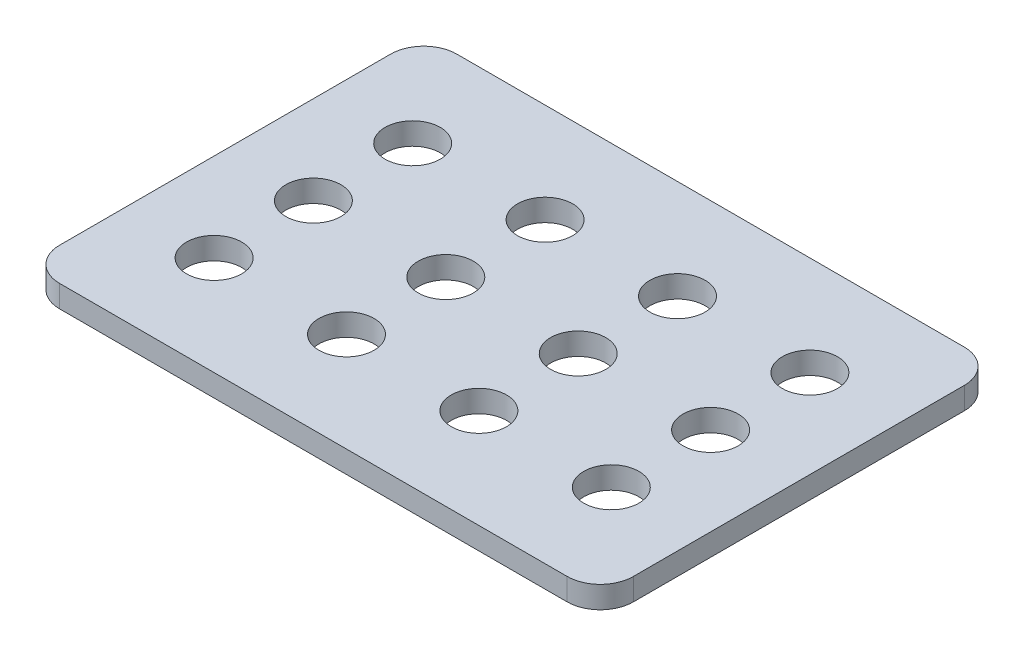
ISO-10303-21;
HEADER;
FILE_DESCRIPTION(('STEP AP214'),'2;1');
FILE_NAME('part.step','',(''),(''),'','','');
FILE_SCHEMA(('AUTOMOTIVE_DESIGN { 1 0 10303 214 1 1 1 1 }'));
ENDSEC;
DATA;
#1=APPLICATION_CONTEXT('core data for automotive mechanical design processes');
#2=APPLICATION_PROTOCOL_DEFINITION('international standard','automotive_design',2000,#1);
#3=PRODUCT_CONTEXT('',#1,'mechanical');
#4=PRODUCT('Part','Part','',(#3));
#5=PRODUCT_RELATED_PRODUCT_CATEGORY('part','',(#4));
#6=PRODUCT_DEFINITION_FORMATION('','',#4);
#7=PRODUCT_DEFINITION_CONTEXT('part definition',#1,'design');
#8=PRODUCT_DEFINITION('design','',#6,#7);
#9=PRODUCT_DEFINITION_SHAPE('','',#8);
#10=(LENGTH_UNIT() NAMED_UNIT(*) SI_UNIT(.MILLI.,.METRE.));
#11=(NAMED_UNIT(*) PLANE_ANGLE_UNIT() SI_UNIT($,.RADIAN.));
#12=(NAMED_UNIT(*) SI_UNIT($,.STERADIAN.) SOLID_ANGLE_UNIT());
#13=UNCERTAINTY_MEASURE_WITH_UNIT(LENGTH_MEASURE(1.E-05),#10,'distance_accuracy_value','');
#14=(GEOMETRIC_REPRESENTATION_CONTEXT(3) GLOBAL_UNCERTAINTY_ASSIGNED_CONTEXT((#13)) GLOBAL_UNIT_ASSIGNED_CONTEXT((#10,
#11,#12)) REPRESENTATION_CONTEXT('',''));
#15=CARTESIAN_POINT('',(0.,0.,0.));
#16=DIRECTION('',(0.,0.,1.));
#17=DIRECTION('',(1.,0.,0.));
#18=AXIS2_PLACEMENT_3D('',#15,#16,#17);
#19=CARTESIAN_POINT('',(-115.,5.,75.));
#20=DIRECTION('',(0.,-1.,0.));
#21=DIRECTION('',(0.,0.,-1.));
#22=AXIS2_PLACEMENT_3D('',#19,#20,#21);
#23=PLANE('',#22);
#24=CARTESIAN_POINT('',(-115.,5.,75.));
#25=DIRECTION('',(0.,1.,0.));
#26=DIRECTION('',(0.,0.,-1.));
#27=AXIS2_PLACEMENT_3D('',#24,#25,#26);
#28=CIRCLE('',#27,15.);
#29=CARTESIAN_POINT('',(-130.,5.,74.9999999999999));
#30=VERTEX_POINT('',#29);
#31=CARTESIAN_POINT('',(-115.,5.,90.));
#32=VERTEX_POINT('',#31);
#33=EDGE_CURVE('E168',#30,#32,#28,.T.);
#34=ORIENTED_EDGE('',*,*,#33,.T.);
#35=DIRECTION('',(1.,0.,0.));
#36=VECTOR('',#35,1.);
#37=CARTESIAN_POINT('',(-115.,5.,90.));
#38=LINE('',#37,#36);
#39=CARTESIAN_POINT('',(115.,5.,90.));
#40=VERTEX_POINT('',#39);
#41=EDGE_CURVE('E104',#32,#40,#38,.T.);
#42=ORIENTED_EDGE('',*,*,#41,.T.);
#43=CARTESIAN_POINT('',(115.,5.,75.));
#44=DIRECTION('',(0.,1.,0.));
#45=DIRECTION('',(0.,0.,1.));
#46=AXIS2_PLACEMENT_3D('',#43,#44,#45);
#47=CIRCLE('',#46,15.);
#48=CARTESIAN_POINT('',(130.,5.,74.9999999999999));
#49=VERTEX_POINT('',#48);
#50=EDGE_CURVE('E189',#40,#49,#47,.T.);
#51=ORIENTED_EDGE('',*,*,#50,.T.);
#52=DIRECTION('',(0.,0.,-1.));
#53=VECTOR('',#52,1.);
#54=CARTESIAN_POINT('',(130.,5.,74.9999999999999));
#55=LINE('',#54,#53);
#56=CARTESIAN_POINT('',(130.,5.,-74.9999999999999));
#57=VERTEX_POINT('',#56);
#58=EDGE_CURVE('E203',#49,#57,#55,.T.);
#59=ORIENTED_EDGE('',*,*,#58,.T.);
#60=CARTESIAN_POINT('',(115.,5.,-75.));
#61=DIRECTION('',(0.,1.,0.));
#62=DIRECTION('',(0.,0.,-1.));
#63=AXIS2_PLACEMENT_3D('',#60,#61,#62);
#64=CIRCLE('',#63,15.);
#65=CARTESIAN_POINT('',(115.,5.,-90.));
#66=VERTEX_POINT('',#65);
#67=EDGE_CURVE('E123',#57,#66,#64,.T.);
#68=ORIENTED_EDGE('',*,*,#67,.T.);
#69=DIRECTION('',(-1.,0.,0.));
#70=VECTOR('',#69,1.);
#71=CARTESIAN_POINT('',(-115.,5.,-90.));
#72=LINE('',#71,#70);
#73=CARTESIAN_POINT('',(-115.,5.,-90.));
#74=VERTEX_POINT('',#73);
#75=EDGE_CURVE('E117',#66,#74,#72,.T.);
#76=ORIENTED_EDGE('',*,*,#75,.T.);
#77=CARTESIAN_POINT('',(-115.,5.,-75.));
#78=DIRECTION('',(0.,1.,0.));
#79=DIRECTION('',(0.,0.,-1.));
#80=AXIS2_PLACEMENT_3D('',#77,#78,#79);
#81=CIRCLE('',#80,15.);
#82=CARTESIAN_POINT('',(-130.,5.,-74.9999999999999));
#83=VERTEX_POINT('',#82);
#84=EDGE_CURVE('E121',#74,#83,#81,.T.);
#85=ORIENTED_EDGE('',*,*,#84,.T.);
#86=DIRECTION('',(0.,0.,1.));
#87=VECTOR('',#86,1.);
#88=CARTESIAN_POINT('',(-130.,5.,74.9999999999999));
#89=LINE('',#88,#87);
#90=EDGE_CURVE('E61',#83,#30,#89,.T.);
#91=ORIENTED_EDGE('',*,*,#90,.T.);
#92=EDGE_LOOP('',(#34,#42,#51,#59,#68,#76,#85,#91));
#93=FACE_BOUND('',#92,.T.);
#94=CARTESIAN_POINT('',(-90.,5.,-45.));
#95=DIRECTION('',(0.,1.,0.));
#96=DIRECTION('',(0.,0.,1.));
#97=AXIS2_PLACEMENT_3D('',#94,#95,#96);
#98=CIRCLE('',#97,12.5);
#99=CARTESIAN_POINT('',(-90.,5.,-32.5));
#100=VERTEX_POINT('',#99);
#101=EDGE_CURVE('E150',#100,#100,#98,.T.);
#102=ORIENTED_EDGE('',*,*,#101,.F.);
#103=EDGE_LOOP('',(#102));
#104=FACE_BOUND('',#103,.T.);
#105=CARTESIAN_POINT('',(-30.,5.,-45.));
#106=DIRECTION('',(0.,1.,0.));
#107=DIRECTION('',(0.,0.,1.));
#108=AXIS2_PLACEMENT_3D('',#105,#106,#107);
#109=CIRCLE('',#108,12.5);
#110=CARTESIAN_POINT('',(-30.,5.,-32.5));
#111=VERTEX_POINT('',#110);
#112=EDGE_CURVE('E217',#111,#111,#109,.T.);
#113=ORIENTED_EDGE('',*,*,#112,.F.);
#114=EDGE_LOOP('',(#113));
#115=FACE_BOUND('',#114,.T.);
#116=CARTESIAN_POINT('',(30.,5.,-45.));
#117=DIRECTION('',(0.,1.,0.));
#118=DIRECTION('',(0.,0.,1.));
#119=AXIS2_PLACEMENT_3D('',#116,#117,#118);
#120=CIRCLE('',#119,12.5);
#121=CARTESIAN_POINT('',(30.,5.,-32.5));
#122=VERTEX_POINT('',#121);
#123=EDGE_CURVE('E225',#122,#122,#120,.T.);
#124=ORIENTED_EDGE('',*,*,#123,.F.);
#125=EDGE_LOOP('',(#124));
#126=FACE_BOUND('',#125,.T.);
#127=CARTESIAN_POINT('',(90.,5.,-45.));
#128=DIRECTION('',(0.,1.,0.));
#129=DIRECTION('',(0.,0.,1.));
#130=AXIS2_PLACEMENT_3D('',#127,#128,#129);
#131=CIRCLE('',#130,12.5);
#132=CARTESIAN_POINT('',(90.,5.,-32.5));
#133=VERTEX_POINT('',#132);
#134=EDGE_CURVE('E233',#133,#133,#131,.T.);
#135=ORIENTED_EDGE('',*,*,#134,.F.);
#136=EDGE_LOOP('',(#135));
#137=FACE_BOUND('',#136,.T.);
#138=CARTESIAN_POINT('',(-29.9999999999996,5.,0.));
#139=DIRECTION('',(0.,1.,0.));
#140=DIRECTION('',(0.,0.,1.));
#141=AXIS2_PLACEMENT_3D('',#138,#139,#140);
#142=CIRCLE('',#141,12.5);
#143=CARTESIAN_POINT('',(-29.9999999999996,5.,12.5));
#144=VERTEX_POINT('',#143);
#145=EDGE_CURVE('E241',#144,#144,#142,.T.);
#146=ORIENTED_EDGE('',*,*,#145,.F.);
#147=EDGE_LOOP('',(#146));
#148=FACE_BOUND('',#147,.T.);
#149=CARTESIAN_POINT('',(30.0000000000004,5.,0.));
#150=DIRECTION('',(0.,1.,0.));
#151=DIRECTION('',(0.,0.,1.));
#152=AXIS2_PLACEMENT_3D('',#149,#150,#151);
#153=CIRCLE('',#152,12.5);
#154=CARTESIAN_POINT('',(30.0000000000004,5.,12.5));
#155=VERTEX_POINT('',#154);
#156=EDGE_CURVE('E249',#155,#155,#153,.T.);
#157=ORIENTED_EDGE('',*,*,#156,.F.);
#158=EDGE_LOOP('',(#157));
#159=FACE_BOUND('',#158,.T.);
#160=CARTESIAN_POINT('',(90.0000000000004,5.,0.));
#161=DIRECTION('',(0.,1.,0.));
#162=DIRECTION('',(0.,0.,1.));
#163=AXIS2_PLACEMENT_3D('',#160,#161,#162);
#164=CIRCLE('',#163,12.5);
#165=CARTESIAN_POINT('',(90.0000000000004,5.,12.5));
#166=VERTEX_POINT('',#165);
#167=EDGE_CURVE('E257',#166,#166,#164,.T.);
#168=ORIENTED_EDGE('',*,*,#167,.F.);
#169=EDGE_LOOP('',(#168));
#170=FACE_BOUND('',#169,.T.);
#171=CARTESIAN_POINT('',(-29.9999999999991,5.,45.));
#172=DIRECTION('',(0.,1.,0.));
#173=DIRECTION('',(0.,0.,1.));
#174=AXIS2_PLACEMENT_3D('',#171,#172,#173);
#175=CIRCLE('',#174,12.5);
#176=CARTESIAN_POINT('',(-29.9999999999991,5.,57.5));
#177=VERTEX_POINT('',#176);
#178=EDGE_CURVE('E265',#177,#177,#175,.T.);
#179=ORIENTED_EDGE('',*,*,#178,.F.);
#180=EDGE_LOOP('',(#179));
#181=FACE_BOUND('',#180,.T.);
#182=CARTESIAN_POINT('',(30.0000000000009,5.,45.));
#183=DIRECTION('',(0.,1.,0.));
#184=DIRECTION('',(0.,0.,1.));
#185=AXIS2_PLACEMENT_3D('',#182,#183,#184);
#186=CIRCLE('',#185,12.5);
#187=CARTESIAN_POINT('',(30.0000000000009,5.,57.5));
#188=VERTEX_POINT('',#187);
#189=EDGE_CURVE('E273',#188,#188,#186,.T.);
#190=ORIENTED_EDGE('',*,*,#189,.F.);
#191=EDGE_LOOP('',(#190));
#192=FACE_BOUND('',#191,.T.);
#193=CARTESIAN_POINT('',(90.0000000000009,5.,45.));
#194=DIRECTION('',(0.,1.,0.));
#195=DIRECTION('',(0.,0.,1.));
#196=AXIS2_PLACEMENT_3D('',#193,#194,#195);
#197=CIRCLE('',#196,12.5);
#198=CARTESIAN_POINT('',(90.0000000000009,5.,57.5));
#199=VERTEX_POINT('',#198);
#200=EDGE_CURVE('E281',#199,#199,#197,.T.);
#201=ORIENTED_EDGE('',*,*,#200,.F.);
#202=EDGE_LOOP('',(#201));
#203=FACE_BOUND('',#202,.T.);
#204=CARTESIAN_POINT('',(-89.9999999999996,5.,0.));
#205=DIRECTION('',(0.,1.,0.));
#206=DIRECTION('',(0.,0.,1.));
#207=AXIS2_PLACEMENT_3D('',#204,#205,#206);
#208=CIRCLE('',#207,12.5);
#209=CARTESIAN_POINT('',(-89.9999999999996,5.,12.5));
#210=VERTEX_POINT('',#209);
#211=EDGE_CURVE('E289',#210,#210,#208,.T.);
#212=ORIENTED_EDGE('',*,*,#211,.F.);
#213=EDGE_LOOP('',(#212));
#214=FACE_BOUND('',#213,.T.);
#215=CARTESIAN_POINT('',(-89.9999999999991,5.,45.));
#216=DIRECTION('',(0.,1.,0.));
#217=DIRECTION('',(0.,0.,1.));
#218=AXIS2_PLACEMENT_3D('',#215,#216,#217);
#219=CIRCLE('',#218,12.5);
#220=CARTESIAN_POINT('',(-89.9999999999991,5.,57.5));
#221=VERTEX_POINT('',#220);
#222=EDGE_CURVE('E297',#221,#221,#219,.T.);
#223=ORIENTED_EDGE('',*,*,#222,.F.);
#224=EDGE_LOOP('',(#223));
#225=FACE_BOUND('',#224,.T.);
#226=ADVANCED_FACE('F43',(#93,#104,#115,#126,#137,#148,#159,#170,#181,#192,#203,#214,#225),#23,.F.);
#227=CARTESIAN_POINT('',(-115.,-5.,75.));
#228=DIRECTION('',(0.,-1.,0.));
#229=DIRECTION('',(0.,0.,-1.));
#230=AXIS2_PLACEMENT_3D('',#227,#228,#229);
#231=PLANE('',#230);
#232=CARTESIAN_POINT('',(-89.9999999999996,-5.,0.));
#233=DIRECTION('',(0.,1.,0.));
#234=DIRECTION('',(0.,0.,1.));
#235=AXIS2_PLACEMENT_3D('',#232,#233,#234);
#236=CIRCLE('',#235,12.5);
#237=CARTESIAN_POINT('',(-89.9999999999996,-5.,12.5));
#238=VERTEX_POINT('',#237);
#239=EDGE_CURVE('E293',#238,#238,#236,.T.);
#240=ORIENTED_EDGE('',*,*,#239,.T.);
#241=EDGE_LOOP('',(#240));
#242=FACE_BOUND('',#241,.T.);
#243=CARTESIAN_POINT('',(30.0000000000009,-5.,45.));
#244=DIRECTION('',(0.,1.,0.));
#245=DIRECTION('',(0.,0.,1.));
#246=AXIS2_PLACEMENT_3D('',#243,#244,#245);
#247=CIRCLE('',#246,12.5);
#248=CARTESIAN_POINT('',(30.0000000000009,-5.,57.5));
#249=VERTEX_POINT('',#248);
#250=EDGE_CURVE('E277',#249,#249,#247,.T.);
#251=ORIENTED_EDGE('',*,*,#250,.T.);
#252=EDGE_LOOP('',(#251));
#253=FACE_BOUND('',#252,.T.);
#254=CARTESIAN_POINT('',(90.0000000000004,-5.,0.));
#255=DIRECTION('',(0.,1.,0.));
#256=DIRECTION('',(0.,0.,1.));
#257=AXIS2_PLACEMENT_3D('',#254,#255,#256);
#258=CIRCLE('',#257,12.5);
#259=CARTESIAN_POINT('',(90.0000000000004,-5.,12.5));
#260=VERTEX_POINT('',#259);
#261=EDGE_CURVE('E261',#260,#260,#258,.T.);
#262=ORIENTED_EDGE('',*,*,#261,.T.);
#263=EDGE_LOOP('',(#262));
#264=FACE_BOUND('',#263,.T.);
#265=CARTESIAN_POINT('',(-29.9999999999996,-5.,0.));
#266=DIRECTION('',(0.,1.,0.));
#267=DIRECTION('',(0.,0.,1.));
#268=AXIS2_PLACEMENT_3D('',#265,#266,#267);
#269=CIRCLE('',#268,12.5);
#270=CARTESIAN_POINT('',(-29.9999999999996,-5.,12.5));
#271=VERTEX_POINT('',#270);
#272=EDGE_CURVE('E245',#271,#271,#269,.T.);
#273=ORIENTED_EDGE('',*,*,#272,.T.);
#274=EDGE_LOOP('',(#273));
#275=FACE_BOUND('',#274,.T.);
#276=CARTESIAN_POINT('',(30.,-5.,-45.));
#277=DIRECTION('',(0.,1.,0.));
#278=DIRECTION('',(0.,0.,1.));
#279=AXIS2_PLACEMENT_3D('',#276,#277,#278);
#280=CIRCLE('',#279,12.5);
#281=CARTESIAN_POINT('',(30.,-5.,-32.5));
#282=VERTEX_POINT('',#281);
#283=EDGE_CURVE('E229',#282,#282,#280,.T.);
#284=ORIENTED_EDGE('',*,*,#283,.T.);
#285=EDGE_LOOP('',(#284));
#286=FACE_BOUND('',#285,.T.);
#287=CARTESIAN_POINT('',(-90.,-5.,-45.));
#288=DIRECTION('',(0.,1.,0.));
#289=DIRECTION('',(0.,0.,1.));
#290=AXIS2_PLACEMENT_3D('',#287,#288,#289);
#291=CIRCLE('',#290,12.5);
#292=CARTESIAN_POINT('',(-90.,-5.,-32.5));
#293=VERTEX_POINT('',#292);
#294=EDGE_CURVE('E213',#293,#293,#291,.T.);
#295=ORIENTED_EDGE('',*,*,#294,.T.);
#296=EDGE_LOOP('',(#295));
#297=FACE_BOUND('',#296,.T.);
#298=CARTESIAN_POINT('',(-115.,-5.,75.));
#299=DIRECTION('',(0.,1.,0.));
#300=DIRECTION('',(0.,0.,-1.));
#301=AXIS2_PLACEMENT_3D('',#298,#299,#300);
#302=CIRCLE('',#301,15.);
#303=CARTESIAN_POINT('',(-130.,-5.,74.9999999999999));
#304=VERTEX_POINT('',#303);
#305=CARTESIAN_POINT('',(-115.,-5.,90.));
#306=VERTEX_POINT('',#305);
#307=EDGE_CURVE('E145',#304,#306,#302,.T.);
#308=ORIENTED_EDGE('',*,*,#307,.F.);
#309=DIRECTION('',(0.,0.,1.));
#310=VECTOR('',#309,1.);
#311=CARTESIAN_POINT('',(-130.,-5.,74.9999999999999));
#312=LINE('',#311,#310);
#313=CARTESIAN_POINT('',(-130.,-5.,-74.9999999999999));
#314=VERTEX_POINT('',#313);
#315=EDGE_CURVE('E96',#314,#304,#312,.T.);
#316=ORIENTED_EDGE('',*,*,#315,.F.);
#317=CARTESIAN_POINT('',(-115.,-5.,-75.));
#318=DIRECTION('',(0.,1.,0.));
#319=DIRECTION('',(0.,0.,-1.));
#320=AXIS2_PLACEMENT_3D('',#317,#318,#319);
#321=CIRCLE('',#320,15.);
#322=CARTESIAN_POINT('',(-115.,-5.,-90.));
#323=VERTEX_POINT('',#322);
#324=EDGE_CURVE('E90',#323,#314,#321,.T.);
#325=ORIENTED_EDGE('',*,*,#324,.F.);
#326=DIRECTION('',(-1.,0.,0.));
#327=VECTOR('',#326,1.);
#328=CARTESIAN_POINT('',(-115.,-5.,-90.));
#329=LINE('',#328,#327);
#330=CARTESIAN_POINT('',(115.,-5.,-90.));
#331=VERTEX_POINT('',#330);
#332=EDGE_CURVE('E132',#331,#323,#329,.T.);
#333=ORIENTED_EDGE('',*,*,#332,.F.);
#334=CARTESIAN_POINT('',(115.,-5.,-75.));
#335=DIRECTION('',(0.,1.,0.));
#336=DIRECTION('',(0.,0.,-1.));
#337=AXIS2_PLACEMENT_3D('',#334,#335,#336);
#338=CIRCLE('',#337,15.);
#339=CARTESIAN_POINT('',(130.,-5.,-74.9999999999999));
#340=VERTEX_POINT('',#339);
#341=EDGE_CURVE('E159',#340,#331,#338,.T.);
#342=ORIENTED_EDGE('',*,*,#341,.F.);
#343=DIRECTION('',(0.,0.,-1.));
#344=VECTOR('',#343,1.);
#345=CARTESIAN_POINT('',(130.,-5.,74.9999999999999));
#346=LINE('',#345,#344);
#347=CARTESIAN_POINT('',(130.,-5.,74.9999999999999));
#348=VERTEX_POINT('',#347);
#349=EDGE_CURVE('E156',#348,#340,#346,.T.);
#350=ORIENTED_EDGE('',*,*,#349,.F.);
#351=CARTESIAN_POINT('',(115.,-5.,75.));
#352=DIRECTION('',(0.,1.,0.));
#353=DIRECTION('',(0.,0.,1.));
#354=AXIS2_PLACEMENT_3D('',#351,#352,#353);
#355=CIRCLE('',#354,15.);
#356=CARTESIAN_POINT('',(115.,-5.,90.));
#357=VERTEX_POINT('',#356);
#358=EDGE_CURVE('E153',#357,#348,#355,.T.);
#359=ORIENTED_EDGE('',*,*,#358,.F.);
#360=DIRECTION('',(1.,0.,0.));
#361=VECTOR('',#360,1.);
#362=CARTESIAN_POINT('',(-115.,-5.,90.));
#363=LINE('',#362,#361);
#364=EDGE_CURVE('E149',#306,#357,#363,.T.);
#365=ORIENTED_EDGE('',*,*,#364,.F.);
#366=EDGE_LOOP('',(#308,#316,#325,#333,#342,#350,#359,#365));
#367=FACE_BOUND('',#366,.T.);
#368=CARTESIAN_POINT('',(-30.,-5.,-45.));
#369=DIRECTION('',(0.,1.,0.));
#370=DIRECTION('',(0.,0.,1.));
#371=AXIS2_PLACEMENT_3D('',#368,#369,#370);
#372=CIRCLE('',#371,12.5);
#373=CARTESIAN_POINT('',(-30.,-5.,-32.5));
#374=VERTEX_POINT('',#373);
#375=EDGE_CURVE('E221',#374,#374,#372,.T.);
#376=ORIENTED_EDGE('',*,*,#375,.T.);
#377=EDGE_LOOP('',(#376));
#378=FACE_BOUND('',#377,.T.);
#379=CARTESIAN_POINT('',(90.,-5.,-45.));
#380=DIRECTION('',(0.,1.,0.));
#381=DIRECTION('',(0.,0.,1.));
#382=AXIS2_PLACEMENT_3D('',#379,#380,#381);
#383=CIRCLE('',#382,12.5);
#384=CARTESIAN_POINT('',(90.,-5.,-32.5));
#385=VERTEX_POINT('',#384);
#386=EDGE_CURVE('E237',#385,#385,#383,.T.);
#387=ORIENTED_EDGE('',*,*,#386,.T.);
#388=EDGE_LOOP('',(#387));
#389=FACE_BOUND('',#388,.T.);
#390=CARTESIAN_POINT('',(30.0000000000004,-5.,0.));
#391=DIRECTION('',(0.,1.,0.));
#392=DIRECTION('',(0.,0.,1.));
#393=AXIS2_PLACEMENT_3D('',#390,#391,#392);
#394=CIRCLE('',#393,12.5);
#395=CARTESIAN_POINT('',(30.0000000000004,-5.,12.5));
#396=VERTEX_POINT('',#395);
#397=EDGE_CURVE('E253',#396,#396,#394,.T.);
#398=ORIENTED_EDGE('',*,*,#397,.T.);
#399=EDGE_LOOP('',(#398));
#400=FACE_BOUND('',#399,.T.);
#401=CARTESIAN_POINT('',(-29.9999999999991,-5.,45.));
#402=DIRECTION('',(0.,1.,0.));
#403=DIRECTION('',(0.,0.,1.));
#404=AXIS2_PLACEMENT_3D('',#401,#402,#403);
#405=CIRCLE('',#404,12.5);
#406=CARTESIAN_POINT('',(-29.9999999999991,-5.,57.5));
#407=VERTEX_POINT('',#406);
#408=EDGE_CURVE('E269',#407,#407,#405,.T.);
#409=ORIENTED_EDGE('',*,*,#408,.T.);
#410=EDGE_LOOP('',(#409));
#411=FACE_BOUND('',#410,.T.);
#412=CARTESIAN_POINT('',(90.0000000000009,-5.,45.));
#413=DIRECTION('',(0.,1.,0.));
#414=DIRECTION('',(0.,0.,1.));
#415=AXIS2_PLACEMENT_3D('',#412,#413,#414);
#416=CIRCLE('',#415,12.5);
#417=CARTESIAN_POINT('',(90.0000000000009,-5.,57.5));
#418=VERTEX_POINT('',#417);
#419=EDGE_CURVE('E285',#418,#418,#416,.T.);
#420=ORIENTED_EDGE('',*,*,#419,.T.);
#421=EDGE_LOOP('',(#420));
#422=FACE_BOUND('',#421,.T.);
#423=CARTESIAN_POINT('',(-89.9999999999991,-5.,45.));
#424=DIRECTION('',(0.,1.,0.));
#425=DIRECTION('',(0.,0.,1.));
#426=AXIS2_PLACEMENT_3D('',#423,#424,#425);
#427=CIRCLE('',#426,12.5);
#428=CARTESIAN_POINT('',(-89.9999999999991,-5.,57.5));
#429=VERTEX_POINT('',#428);
#430=EDGE_CURVE('E301',#429,#429,#427,.T.);
#431=ORIENTED_EDGE('',*,*,#430,.T.);
#432=EDGE_LOOP('',(#431));
#433=FACE_BOUND('',#432,.T.);
#434=ADVANCED_FACE('F193',(#242,#253,#264,#275,#286,#297,#367,#378,#389,#400,#411,#422,#433),
#231,.T.);
#435=CARTESIAN_POINT('',(-115.,5.,75.));
#436=DIRECTION('',(0.,-1.,0.));
#437=DIRECTION('',(0.,0.,-1.));
#438=AXIS2_PLACEMENT_3D('',#435,#436,#437);
#439=CYLINDRICAL_SURFACE('',#438,15.);
#440=ORIENTED_EDGE('',*,*,#307,.T.);
#441=DIRECTION('',(0.,-1.,0.));
#442=VECTOR('',#441,1.);
#443=CARTESIAN_POINT('',(-115.,5.,90.));
#444=LINE('',#443,#442);
#445=EDGE_CURVE('E11',#32,#306,#444,.T.);
#446=ORIENTED_EDGE('',*,*,#445,.F.);
#447=ORIENTED_EDGE('',*,*,#33,.F.);
#448=DIRECTION('',(0.,-1.,0.));
#449=VECTOR('',#448,1.);
#450=CARTESIAN_POINT('',(-130.,5.,74.9999999999999));
#451=LINE('',#450,#449);
#452=EDGE_CURVE('E141',#30,#304,#451,.T.);
#453=ORIENTED_EDGE('',*,*,#452,.T.);
#454=EDGE_LOOP('',(#440,#446,#447,#453));
#455=FACE_BOUND('',#454,.T.);
#456=ADVANCED_FACE('F45',(#455),#439,.T.);
#457=CARTESIAN_POINT('',(-115.,5.,90.));
#458=DIRECTION('',(0.,0.,-1.));
#459=DIRECTION('',(-1.,0.,0.));
#460=AXIS2_PLACEMENT_3D('',#457,#458,#459);
#461=PLANE('',#460);
#462=ORIENTED_EDGE('',*,*,#364,.T.);
#463=DIRECTION('',(0.,-1.,0.));
#464=VECTOR('',#463,1.);
#465=CARTESIAN_POINT('',(115.,5.,90.));
#466=LINE('',#465,#464);
#467=EDGE_CURVE('E53',#40,#357,#466,.T.);
#468=ORIENTED_EDGE('',*,*,#467,.F.);
#469=ORIENTED_EDGE('',*,*,#41,.F.);
#470=ORIENTED_EDGE('',*,*,#445,.T.);
#471=EDGE_LOOP('',(#462,#468,#469,#470));
#472=FACE_BOUND('',#471,.T.);
#473=ADVANCED_FACE('F335',(#472),#461,.F.);
#474=CARTESIAN_POINT('',(115.,5.,75.));
#475=DIRECTION('',(0.,-1.,0.));
#476=DIRECTION('',(0.,0.,-1.));
#477=AXIS2_PLACEMENT_3D('',#474,#475,#476);
#478=CYLINDRICAL_SURFACE('',#477,15.);
#479=ORIENTED_EDGE('',*,*,#358,.T.);
#480=DIRECTION('',(0.,-1.,0.));
#481=VECTOR('',#480,1.);
#482=CARTESIAN_POINT('',(130.,5.,74.9999999999999));
#483=LINE('',#482,#481);
#484=EDGE_CURVE('E179',#49,#348,#483,.T.);
#485=ORIENTED_EDGE('',*,*,#484,.F.);
#486=ORIENTED_EDGE('',*,*,#50,.F.);
#487=ORIENTED_EDGE('',*,*,#467,.T.);
#488=EDGE_LOOP('',(#479,#485,#486,#487));
#489=FACE_BOUND('',#488,.T.);
#490=ADVANCED_FACE('F187',(#489),#478,.T.);
#491=CARTESIAN_POINT('',(130.,5.,74.9999999999999));
#492=DIRECTION('',(-1.,0.,0.));
#493=DIRECTION('',(0.,0.,1.));
#494=AXIS2_PLACEMENT_3D('',#491,#492,#493);
#495=PLANE('',#494);
#496=ORIENTED_EDGE('',*,*,#349,.T.);
#497=DIRECTION('',(0.,-1.,0.));
#498=VECTOR('',#497,1.);
#499=CARTESIAN_POINT('',(130.,5.,-74.9999999999999));
#500=LINE('',#499,#498);
#501=EDGE_CURVE('E175',#57,#340,#500,.T.);
#502=ORIENTED_EDGE('',*,*,#501,.F.);
#503=ORIENTED_EDGE('',*,*,#58,.F.);
#504=ORIENTED_EDGE('',*,*,#484,.T.);
#505=EDGE_LOOP('',(#496,#502,#503,#504));
#506=FACE_BOUND('',#505,.T.);
#507=ADVANCED_FACE('F198',(#506),#495,.F.);
#508=CARTESIAN_POINT('',(115.,5.,-75.));
#509=DIRECTION('',(0.,-1.,0.));
#510=DIRECTION('',(0.,0.,-1.));
#511=AXIS2_PLACEMENT_3D('',#508,#509,#510);
#512=CYLINDRICAL_SURFACE('',#511,15.);
#513=ORIENTED_EDGE('',*,*,#341,.T.);
#514=DIRECTION('',(0.,-1.,0.));
#515=VECTOR('',#514,1.);
#516=CARTESIAN_POINT('',(115.,5.,-90.));
#517=LINE('',#516,#515);
#518=EDGE_CURVE('E134',#66,#331,#517,.T.);
#519=ORIENTED_EDGE('',*,*,#518,.F.);
#520=ORIENTED_EDGE('',*,*,#67,.F.);
#521=ORIENTED_EDGE('',*,*,#501,.T.);
#522=EDGE_LOOP('',(#513,#519,#520,#521));
#523=FACE_BOUND('',#522,.T.);
#524=ADVANCED_FACE('F201',(#523),#512,.T.);
#525=CARTESIAN_POINT('',(-115.,5.,-90.));
#526=DIRECTION('',(0.,0.,1.));
#527=DIRECTION('',(1.,0.,0.));
#528=AXIS2_PLACEMENT_3D('',#525,#526,#527);
#529=PLANE('',#528);
#530=ORIENTED_EDGE('',*,*,#332,.T.);
#531=DIRECTION('',(0.,-1.,0.));
#532=VECTOR('',#531,1.);
#533=CARTESIAN_POINT('',(-115.,5.,-90.));
#534=LINE('',#533,#532);
#535=EDGE_CURVE('E129',#74,#323,#534,.T.);
#536=ORIENTED_EDGE('',*,*,#535,.F.);
#537=ORIENTED_EDGE('',*,*,#75,.F.);
#538=ORIENTED_EDGE('',*,*,#518,.T.);
#539=EDGE_LOOP('',(#530,#536,#537,#538));
#540=FACE_BOUND('',#539,.T.);
#541=ADVANCED_FACE('F130',(#540),#529,.F.);
#542=CARTESIAN_POINT('',(-115.,5.,-75.));
#543=DIRECTION('',(0.,-1.,0.));
#544=DIRECTION('',(0.,0.,-1.));
#545=AXIS2_PLACEMENT_3D('',#542,#543,#544);
#546=CYLINDRICAL_SURFACE('',#545,15.);
#547=ORIENTED_EDGE('',*,*,#324,.T.);
#548=DIRECTION('',(0.,-1.,0.));
#549=VECTOR('',#548,1.);
#550=CARTESIAN_POINT('',(-130.,5.,-74.9999999999999));
#551=LINE('',#550,#549);
#552=EDGE_CURVE('E135',#83,#314,#551,.T.);
#553=ORIENTED_EDGE('',*,*,#552,.F.);
#554=ORIENTED_EDGE('',*,*,#84,.F.);
#555=ORIENTED_EDGE('',*,*,#535,.T.);
#556=EDGE_LOOP('',(#547,#553,#554,#555));
#557=FACE_BOUND('',#556,.T.);
#558=ADVANCED_FACE('F137',(#557),#546,.T.);
#559=CARTESIAN_POINT('',(-130.,5.,74.9999999999999));
#560=DIRECTION('',(1.,0.,0.));
#561=DIRECTION('',(0.,0.,-1.));
#562=AXIS2_PLACEMENT_3D('',#559,#560,#561);
#563=PLANE('',#562);
#564=ORIENTED_EDGE('',*,*,#315,.T.);
#565=ORIENTED_EDGE('',*,*,#452,.F.);
#566=ORIENTED_EDGE('',*,*,#90,.F.);
#567=ORIENTED_EDGE('',*,*,#552,.T.);
#568=EDGE_LOOP('',(#564,#565,#566,#567));
#569=FACE_BOUND('',#568,.T.);
#570=ADVANCED_FACE('F323',(#569),#563,.F.);
#571=CARTESIAN_POINT('',(-90.,5.,-45.));
#572=DIRECTION('',(0.,-1.,0.));
#573=DIRECTION('',(0.,0.,-1.));
#574=AXIS2_PLACEMENT_3D('',#571,#572,#573);
#575=CYLINDRICAL_SURFACE('',#574,12.5);
#576=ORIENTED_EDGE('',*,*,#101,.T.);
#577=EDGE_LOOP('',(#576));
#578=FACE_BOUND('',#577,.T.);
#579=ORIENTED_EDGE('',*,*,#294,.F.);
#580=EDGE_LOOP('',(#579));
#581=FACE_BOUND('',#580,.T.);
#582=ADVANCED_FACE('F320',(#578,#581),#575,.F.);
#583=CARTESIAN_POINT('',(-30.,5.,-45.));
#584=DIRECTION('',(0.,-1.,0.));
#585=DIRECTION('',(0.,0.,-1.));
#586=AXIS2_PLACEMENT_3D('',#583,#584,#585);
#587=CYLINDRICAL_SURFACE('',#586,12.5);
#588=ORIENTED_EDGE('',*,*,#112,.T.);
#589=EDGE_LOOP('',(#588));
#590=FACE_BOUND('',#589,.T.);
#591=ORIENTED_EDGE('',*,*,#375,.F.);
#592=EDGE_LOOP('',(#591));
#593=FACE_BOUND('',#592,.T.);
#594=ADVANCED_FACE('F411',(#590,#593),#587,.F.);
#595=CARTESIAN_POINT('',(30.,5.,-45.));
#596=DIRECTION('',(0.,-1.,0.));
#597=DIRECTION('',(0.,0.,-1.));
#598=AXIS2_PLACEMENT_3D('',#595,#596,#597);
#599=CYLINDRICAL_SURFACE('',#598,12.5);
#600=ORIENTED_EDGE('',*,*,#123,.T.);
#601=EDGE_LOOP('',(#600));
#602=FACE_BOUND('',#601,.T.);
#603=ORIENTED_EDGE('',*,*,#283,.F.);
#604=EDGE_LOOP('',(#603));
#605=FACE_BOUND('',#604,.T.);
#606=ADVANCED_FACE('F420',(#602,#605),#599,.F.);
#607=CARTESIAN_POINT('',(90.,5.,-45.));
#608=DIRECTION('',(0.,-1.,0.));
#609=DIRECTION('',(0.,0.,-1.));
#610=AXIS2_PLACEMENT_3D('',#607,#608,#609);
#611=CYLINDRICAL_SURFACE('',#610,12.5);
#612=ORIENTED_EDGE('',*,*,#134,.T.);
#613=EDGE_LOOP('',(#612));
#614=FACE_BOUND('',#613,.T.);
#615=ORIENTED_EDGE('',*,*,#386,.F.);
#616=EDGE_LOOP('',(#615));
#617=FACE_BOUND('',#616,.T.);
#618=ADVANCED_FACE('F429',(#614,#617),#611,.F.);
#619=CARTESIAN_POINT('',(-29.9999999999996,5.,0.));
#620=DIRECTION('',(0.,-1.,0.));
#621=DIRECTION('',(0.,0.,-1.));
#622=AXIS2_PLACEMENT_3D('',#619,#620,#621);
#623=CYLINDRICAL_SURFACE('',#622,12.5);
#624=ORIENTED_EDGE('',*,*,#145,.T.);
#625=EDGE_LOOP('',(#624));
#626=FACE_BOUND('',#625,.T.);
#627=ORIENTED_EDGE('',*,*,#272,.F.);
#628=EDGE_LOOP('',(#627));
#629=FACE_BOUND('',#628,.T.);
#630=ADVANCED_FACE('F439',(#626,#629),#623,.F.);
#631=CARTESIAN_POINT('',(30.0000000000004,5.,0.));
#632=DIRECTION('',(0.,-1.,0.));
#633=DIRECTION('',(0.,0.,-1.));
#634=AXIS2_PLACEMENT_3D('',#631,#632,#633);
#635=CYLINDRICAL_SURFACE('',#634,12.5);
#636=ORIENTED_EDGE('',*,*,#156,.T.);
#637=EDGE_LOOP('',(#636));
#638=FACE_BOUND('',#637,.T.);
#639=ORIENTED_EDGE('',*,*,#397,.F.);
#640=EDGE_LOOP('',(#639));
#641=FACE_BOUND('',#640,.T.);
#642=ADVANCED_FACE('F449',(#638,#641),#635,.F.);
#643=CARTESIAN_POINT('',(90.0000000000004,5.,0.));
#644=DIRECTION('',(0.,-1.,0.));
#645=DIRECTION('',(0.,0.,-1.));
#646=AXIS2_PLACEMENT_3D('',#643,#644,#645);
#647=CYLINDRICAL_SURFACE('',#646,12.5);
#648=ORIENTED_EDGE('',*,*,#167,.T.);
#649=EDGE_LOOP('',(#648));
#650=FACE_BOUND('',#649,.T.);
#651=ORIENTED_EDGE('',*,*,#261,.F.);
#652=EDGE_LOOP('',(#651));
#653=FACE_BOUND('',#652,.T.);
#654=ADVANCED_FACE('F459',(#650,#653),#647,.F.);
#655=CARTESIAN_POINT('',(-29.9999999999991,5.,45.));
#656=DIRECTION('',(0.,-1.,0.));
#657=DIRECTION('',(0.,0.,-1.));
#658=AXIS2_PLACEMENT_3D('',#655,#656,#657);
#659=CYLINDRICAL_SURFACE('',#658,12.5);
#660=ORIENTED_EDGE('',*,*,#178,.T.);
#661=EDGE_LOOP('',(#660));
#662=FACE_BOUND('',#661,.T.);
#663=ORIENTED_EDGE('',*,*,#408,.F.);
#664=EDGE_LOOP('',(#663));
#665=FACE_BOUND('',#664,.T.);
#666=ADVANCED_FACE('F469',(#662,#665),#659,.F.);
#667=CARTESIAN_POINT('',(30.0000000000009,5.,45.));
#668=DIRECTION('',(0.,-1.,0.));
#669=DIRECTION('',(0.,0.,-1.));
#670=AXIS2_PLACEMENT_3D('',#667,#668,#669);
#671=CYLINDRICAL_SURFACE('',#670,12.5);
#672=ORIENTED_EDGE('',*,*,#189,.T.);
#673=EDGE_LOOP('',(#672));
#674=FACE_BOUND('',#673,.T.);
#675=ORIENTED_EDGE('',*,*,#250,.F.);
#676=EDGE_LOOP('',(#675));
#677=FACE_BOUND('',#676,.T.);
#678=ADVANCED_FACE('F479',(#674,#677),#671,.F.);
#679=CARTESIAN_POINT('',(90.0000000000009,5.,45.));
#680=DIRECTION('',(0.,-1.,0.));
#681=DIRECTION('',(0.,0.,-1.));
#682=AXIS2_PLACEMENT_3D('',#679,#680,#681);
#683=CYLINDRICAL_SURFACE('',#682,12.5);
#684=ORIENTED_EDGE('',*,*,#200,.T.);
#685=EDGE_LOOP('',(#684));
#686=FACE_BOUND('',#685,.T.);
#687=ORIENTED_EDGE('',*,*,#419,.F.);
#688=EDGE_LOOP('',(#687));
#689=FACE_BOUND('',#688,.T.);
#690=ADVANCED_FACE('F489',(#686,#689),#683,.F.);
#691=CARTESIAN_POINT('',(-89.9999999999996,5.,0.));
#692=DIRECTION('',(0.,-1.,0.));
#693=DIRECTION('',(0.,0.,-1.));
#694=AXIS2_PLACEMENT_3D('',#691,#692,#693);
#695=CYLINDRICAL_SURFACE('',#694,12.5);
#696=ORIENTED_EDGE('',*,*,#211,.T.);
#697=EDGE_LOOP('',(#696));
#698=FACE_BOUND('',#697,.T.);
#699=ORIENTED_EDGE('',*,*,#239,.F.);
#700=EDGE_LOOP('',(#699));
#701=FACE_BOUND('',#700,.T.);
#702=ADVANCED_FACE('F499',(#698,#701),#695,.F.);
#703=CARTESIAN_POINT('',(-89.9999999999991,5.,45.));
#704=DIRECTION('',(0.,-1.,0.));
#705=DIRECTION('',(0.,0.,-1.));
#706=AXIS2_PLACEMENT_3D('',#703,#704,#705);
#707=CYLINDRICAL_SURFACE('',#706,12.5);
#708=ORIENTED_EDGE('',*,*,#222,.T.);
#709=EDGE_LOOP('',(#708));
#710=FACE_BOUND('',#709,.T.);
#711=ORIENTED_EDGE('',*,*,#430,.F.);
#712=EDGE_LOOP('',(#711));
#713=FACE_BOUND('',#712,.T.);
#714=ADVANCED_FACE('F309',(#710,#713),#707,.F.);
#715=CLOSED_SHELL('',(#226,#434,#456,#473,#490,#507,#524,#541,#558,#570,#582,#594,#606,#618,
#630,#642,#654,#666,#678,#690,#702,#714));
#716=MANIFOLD_SOLID_BREP('B2',#715);
#717=ADVANCED_BREP_SHAPE_REPRESENTATION('',(#18,#716),#14);
#718=SHAPE_DEFINITION_REPRESENTATION(#9,#717);
ENDSEC;
END-ISO-10303-21;
